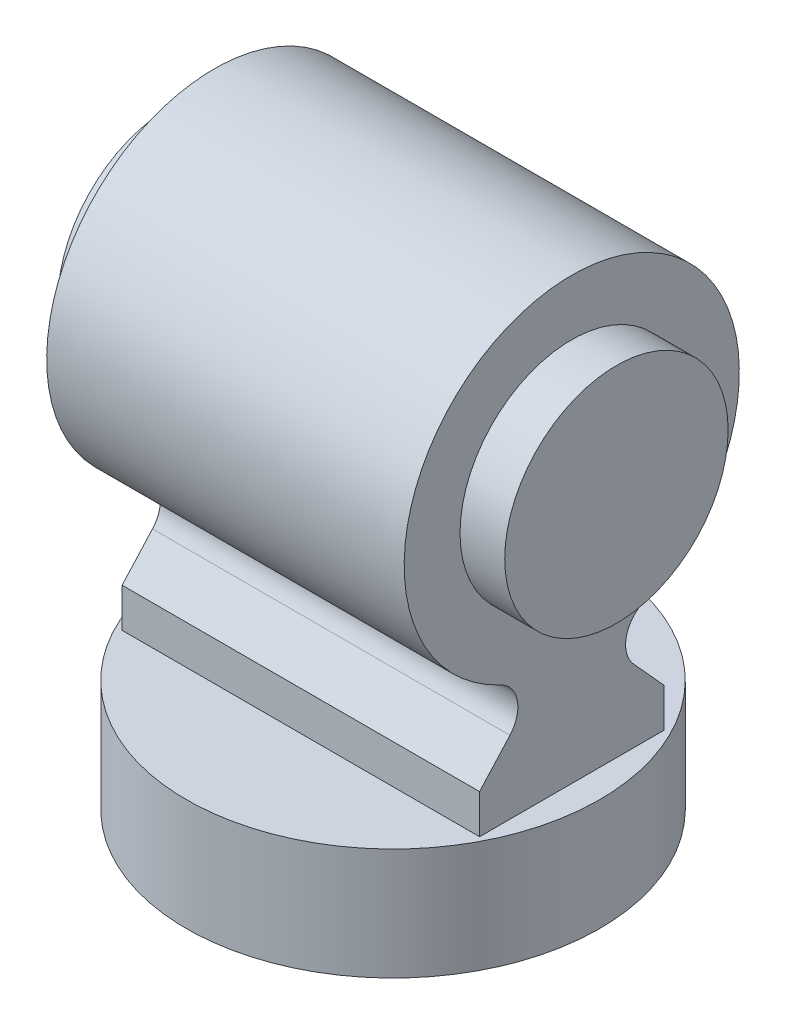
ISO-10303-21;
HEADER;
FILE_DESCRIPTION(('STEP AP214'),'2;1');
FILE_NAME('part.step','',(''),(''),'','','');
FILE_SCHEMA(('AUTOMOTIVE_DESIGN { 1 0 10303 214 1 1 1 1 }'));
ENDSEC;
DATA;
#1=APPLICATION_CONTEXT('core data for automotive mechanical design processes');
#2=APPLICATION_PROTOCOL_DEFINITION('international standard','automotive_design',2000,#1);
#3=PRODUCT_CONTEXT('',#1,'mechanical');
#4=PRODUCT('Part','Part','',(#3));
#5=PRODUCT_RELATED_PRODUCT_CATEGORY('part','',(#4));
#6=PRODUCT_DEFINITION_FORMATION('','',#4);
#7=PRODUCT_DEFINITION_CONTEXT('part definition',#1,'design');
#8=PRODUCT_DEFINITION('design','',#6,#7);
#9=PRODUCT_DEFINITION_SHAPE('','',#8);
#10=(LENGTH_UNIT() NAMED_UNIT(*) SI_UNIT(.MILLI.,.METRE.));
#11=(NAMED_UNIT(*) PLANE_ANGLE_UNIT() SI_UNIT($,.RADIAN.));
#12=(NAMED_UNIT(*) SI_UNIT($,.STERADIAN.) SOLID_ANGLE_UNIT());
#13=UNCERTAINTY_MEASURE_WITH_UNIT(LENGTH_MEASURE(1.E-05),#10,'distance_accuracy_value','');
#14=(GEOMETRIC_REPRESENTATION_CONTEXT(3) GLOBAL_UNCERTAINTY_ASSIGNED_CONTEXT((#13)) GLOBAL_UNIT_ASSIGNED_CONTEXT((#10,
#11,#12)) REPRESENTATION_CONTEXT('',''));
#15=CARTESIAN_POINT('',(0.,0.,0.));
#16=DIRECTION('',(0.,0.,1.));
#17=DIRECTION('',(1.,0.,0.));
#18=AXIS2_PLACEMENT_3D('',#15,#16,#17);
#19=CARTESIAN_POINT('',(-32.,-32.1160022418731,-15.15));
#20=DIRECTION('',(1.,0.,0.));
#21=DIRECTION('',(0.,0.,-1.));
#22=AXIS2_PLACEMENT_3D('',#19,#20,#21);
#23=CYLINDRICAL_SURFACE('',#22,5.51);
#24=DIRECTION('',(1.,0.,0.));
#25=VECTOR('',#24,1.);
#26=CARTESIAN_POINT('',(-32.,-27.132640587333,-12.7992114897212));
#27=LINE('',#26,#25);
#28=CARTESIAN_POINT('',(-32.,-27.132640587333,-12.7992114897212));
#29=VERTEX_POINT('',#28);
#30=CARTESIAN_POINT('',(32.,-27.132640587333,-12.7992114897212));
#31=VERTEX_POINT('',#30);
#32=EDGE_CURVE('E139',#29,#31,#27,.T.);
#33=ORIENTED_EDGE('',*,*,#32,.T.);
#34=CARTESIAN_POINT('',(32.,-32.1160022418731,-15.15));
#35=DIRECTION('',(-1.,0.,0.));
#36=DIRECTION('',(0.,0.,-1.));
#37=AXIS2_PLACEMENT_3D('',#34,#35,#36);
#38=CIRCLE('',#37,5.51);
#39=CARTESIAN_POINT('',(32.,-35.8064974081402,-11.0585032778017));
#40=VERTEX_POINT('',#39);
#41=EDGE_CURVE('E150',#40,#31,#38,.T.);
#42=ORIENTED_EDGE('',*,*,#41,.F.);
#43=DIRECTION('',(1.,0.,0.));
#44=VECTOR('',#43,1.);
#45=CARTESIAN_POINT('',(-32.,-35.8064974081402,-11.0585032778017));
#46=LINE('',#45,#44);
#47=CARTESIAN_POINT('',(-32.,-35.8064974081402,-11.0585032778017));
#48=VERTEX_POINT('',#47);
#49=EDGE_CURVE('E53',#48,#40,#46,.T.);
#50=ORIENTED_EDGE('',*,*,#49,.F.);
#51=CARTESIAN_POINT('',(-32.,-32.1160022418731,-15.15));
#52=DIRECTION('',(-1.,0.,0.));
#53=DIRECTION('',(0.,0.,-1.));
#54=AXIS2_PLACEMENT_3D('',#51,#52,#53);
#55=CIRCLE('',#54,5.51);
#56=EDGE_CURVE('E151',#48,#29,#55,.T.);
#57=ORIENTED_EDGE('',*,*,#56,.T.);
#58=EDGE_LOOP('',(#33,#42,#50,#57));
#59=FACE_BOUND('',#58,.T.);
#60=ADVANCED_FACE('F46',(#59),#23,.F.);
#61=CARTESIAN_POINT('',(-32.,-35.8064974081402,-11.0585032778017));
#62=DIRECTION('',(0.,0.670961371417795,-0.741492304791595));
#63=DIRECTION('',(0.,0.741492304791595,0.670961371417795));
#64=AXIS2_PLACEMENT_3D('',#61,#62,#63);
#65=PLANE('',#64);
#66=ORIENTED_EDGE('',*,*,#49,.T.);
#67=DIRECTION('',(0.,0.741492304791595,0.670961371417795));
#68=VECTOR('',#67,1.);
#69=CARTESIAN_POINT('',(32.,-35.8064974081402,-11.0585032778017));
#70=LINE('',#69,#68);
#71=CARTESIAN_POINT('',(32.,-41.82,-16.5));
#72=VERTEX_POINT('',#71);
#73=EDGE_CURVE('E165',#72,#40,#70,.T.);
#74=ORIENTED_EDGE('',*,*,#73,.F.);
#75=DIRECTION('',(1.,0.,0.));
#76=VECTOR('',#75,1.);
#77=CARTESIAN_POINT('',(-32.,-41.82,-16.5));
#78=LINE('',#77,#76);
#79=CARTESIAN_POINT('',(-32.,-41.82,-16.5));
#80=VERTEX_POINT('',#79);
#81=EDGE_CURVE('E67',#80,#72,#78,.T.);
#82=ORIENTED_EDGE('',*,*,#81,.F.);
#83=DIRECTION('',(0.,0.741492304791595,0.670961371417795));
#84=VECTOR('',#83,1.);
#85=CARTESIAN_POINT('',(-32.,-35.8064974081402,-11.0585032778017));
#86=LINE('',#85,#84);
#87=EDGE_CURVE('E117',#80,#48,#86,.T.);
#88=ORIENTED_EDGE('',*,*,#87,.T.);
#89=EDGE_LOOP('',(#66,#74,#82,#88));
#90=FACE_BOUND('',#89,.T.);
#91=ADVANCED_FACE('F207',(#90),#65,.T.);
#92=CARTESIAN_POINT('',(-32.,-41.82,-16.5));
#93=DIRECTION('',(0.,0.,-1.));
#94=DIRECTION('',(0.,1.,0.));
#95=AXIS2_PLACEMENT_3D('',#92,#93,#94);
#96=PLANE('',#95);
#97=ORIENTED_EDGE('',*,*,#81,.T.);
#98=DIRECTION('',(0.,1.,0.));
#99=VECTOR('',#98,1.);
#100=CARTESIAN_POINT('',(32.,-41.82,-16.5));
#101=LINE('',#100,#99);
#102=CARTESIAN_POINT('',(32.,-48.82,-16.5));
#103=VERTEX_POINT('',#102);
#104=EDGE_CURVE('E125',#103,#72,#101,.T.);
#105=ORIENTED_EDGE('',*,*,#104,.F.);
#106=DIRECTION('',(1.,0.,0.));
#107=VECTOR('',#106,1.);
#108=CARTESIAN_POINT('',(-32.,-48.82,-16.5));
#109=LINE('',#108,#107);
#110=CARTESIAN_POINT('',(-32.,-48.82,-16.5));
#111=VERTEX_POINT('',#110);
#112=EDGE_CURVE('E122',#111,#103,#109,.T.);
#113=ORIENTED_EDGE('',*,*,#112,.F.);
#114=DIRECTION('',(0.,1.,0.));
#115=VECTOR('',#114,1.);
#116=CARTESIAN_POINT('',(-32.,-41.82,-16.5));
#117=LINE('',#116,#115);
#118=EDGE_CURVE('E110',#111,#80,#117,.T.);
#119=ORIENTED_EDGE('',*,*,#118,.T.);
#120=EDGE_LOOP('',(#97,#105,#113,#119));
#121=FACE_BOUND('',#120,.T.);
#122=ADVANCED_FACE('F123',(#121),#96,.T.);
#123=CARTESIAN_POINT('',(-32.,-41.82,16.5));
#124=DIRECTION('',(0.,0.,1.));
#125=DIRECTION('',(0.,-1.,0.));
#126=AXIS2_PLACEMENT_3D('',#123,#124,#125);
#127=PLANE('',#126);
#128=DIRECTION('',(1.,0.,0.));
#129=VECTOR('',#128,1.);
#130=CARTESIAN_POINT('',(-32.,-48.82,16.5));
#131=LINE('',#130,#129);
#132=CARTESIAN_POINT('',(-32.,-48.82,16.5));
#133=VERTEX_POINT('',#132);
#134=CARTESIAN_POINT('',(32.,-48.82,16.5));
#135=VERTEX_POINT('',#134);
#136=EDGE_CURVE('E128',#133,#135,#131,.T.);
#137=ORIENTED_EDGE('',*,*,#136,.T.);
#138=DIRECTION('',(0.,-1.,0.));
#139=VECTOR('',#138,1.);
#140=CARTESIAN_POINT('',(32.,-41.82,16.5));
#141=LINE('',#140,#139);
#142=CARTESIAN_POINT('',(32.,-41.82,16.5));
#143=VERTEX_POINT('',#142);
#144=EDGE_CURVE('E177',#143,#135,#141,.T.);
#145=ORIENTED_EDGE('',*,*,#144,.F.);
#146=DIRECTION('',(1.,0.,0.));
#147=VECTOR('',#146,1.);
#148=CARTESIAN_POINT('',(-32.,-41.82,16.5));
#149=LINE('',#148,#147);
#150=CARTESIAN_POINT('',(-32.,-41.82,16.5));
#151=VERTEX_POINT('',#150);
#152=EDGE_CURVE('E143',#151,#143,#149,.T.);
#153=ORIENTED_EDGE('',*,*,#152,.F.);
#154=DIRECTION('',(0.,-1.,0.));
#155=VECTOR('',#154,1.);
#156=CARTESIAN_POINT('',(-32.,-41.82,16.5));
#157=LINE('',#156,#155);
#158=EDGE_CURVE('E132',#151,#133,#157,.T.);
#159=ORIENTED_EDGE('',*,*,#158,.T.);
#160=EDGE_LOOP('',(#137,#145,#153,#159));
#161=FACE_BOUND('',#160,.T.);
#162=ADVANCED_FACE('F199',(#161),#127,.T.);
#163=CARTESIAN_POINT('',(-32.,-35.8064974081402,11.0585032778017));
#164=DIRECTION('',(0.,0.670961371417795,0.741492304791595));
#165=DIRECTION('',(0.,-0.741492304791595,0.670961371417795));
#166=AXIS2_PLACEMENT_3D('',#163,#164,#165);
#167=PLANE('',#166);
#168=ORIENTED_EDGE('',*,*,#152,.T.);
#169=DIRECTION('',(0.,-0.741492304791595,0.670961371417795));
#170=VECTOR('',#169,1.);
#171=CARTESIAN_POINT('',(32.,-35.8064974081402,11.0585032778017));
#172=LINE('',#171,#170);
#173=CARTESIAN_POINT('',(32.,-35.8064974081402,11.0585032778017));
#174=VERTEX_POINT('',#173);
#175=EDGE_CURVE('E174',#174,#143,#172,.T.);
#176=ORIENTED_EDGE('',*,*,#175,.F.);
#177=DIRECTION('',(1.,0.,0.));
#178=VECTOR('',#177,1.);
#179=CARTESIAN_POINT('',(-32.,-35.8064974081402,11.0585032778017));
#180=LINE('',#179,#178);
#181=CARTESIAN_POINT('',(-32.,-35.8064974081402,11.0585032778017));
#182=VERTEX_POINT('',#181);
#183=EDGE_CURVE('E145',#182,#174,#180,.T.);
#184=ORIENTED_EDGE('',*,*,#183,.F.);
#185=DIRECTION('',(0.,-0.741492304791595,0.670961371417795));
#186=VECTOR('',#185,1.);
#187=CARTESIAN_POINT('',(-32.,-35.8064974081402,11.0585032778017));
#188=LINE('',#187,#186);
#189=EDGE_CURVE('E134',#182,#151,#188,.T.);
#190=ORIENTED_EDGE('',*,*,#189,.T.);
#191=EDGE_LOOP('',(#168,#176,#184,#190));
#192=FACE_BOUND('',#191,.T.);
#193=ADVANCED_FACE('F192',(#192),#167,.T.);
#194=CARTESIAN_POINT('',(-32.,-32.1160022418731,15.15));
#195=DIRECTION('',(1.,0.,0.));
#196=DIRECTION('',(0.,0.,-1.));
#197=AXIS2_PLACEMENT_3D('',#194,#195,#196);
#198=CYLINDRICAL_SURFACE('',#197,5.51);
#199=ORIENTED_EDGE('',*,*,#183,.T.);
#200=CARTESIAN_POINT('',(32.,-32.1160022418731,15.15));
#201=DIRECTION('',(-1.,0.,0.));
#202=DIRECTION('',(0.,0.,1.));
#203=AXIS2_PLACEMENT_3D('',#200,#201,#202);
#204=CIRCLE('',#203,5.51);
#205=CARTESIAN_POINT('',(32.,-27.132640587333,12.7992114897212));
#206=VERTEX_POINT('',#205);
#207=EDGE_CURVE('E161',#206,#174,#204,.T.);
#208=ORIENTED_EDGE('',*,*,#207,.F.);
#209=DIRECTION('',(1.,0.,0.));
#210=VECTOR('',#209,1.);
#211=CARTESIAN_POINT('',(-32.,-27.132640587333,12.7992114897212));
#212=LINE('',#211,#210);
#213=CARTESIAN_POINT('',(-32.,-27.132640587333,12.7992114897212));
#214=VERTEX_POINT('',#213);
#215=EDGE_CURVE('E147',#214,#206,#212,.T.);
#216=ORIENTED_EDGE('',*,*,#215,.F.);
#217=CARTESIAN_POINT('',(-32.,-32.1160022418731,15.15));
#218=DIRECTION('',(-1.,0.,0.));
#219=DIRECTION('',(0.,0.,1.));
#220=AXIS2_PLACEMENT_3D('',#217,#218,#219);
#221=CIRCLE('',#220,5.51);
#222=EDGE_CURVE('E187',#214,#182,#221,.T.);
#223=ORIENTED_EDGE('',*,*,#222,.T.);
#224=EDGE_LOOP('',(#199,#208,#216,#223));
#225=FACE_BOUND('',#224,.T.);
#226=ADVANCED_FACE('F196',(#225),#198,.F.);
#227=CARTESIAN_POINT('',(-32.,0.,0.));
#228=DIRECTION('',(1.,0.,0.));
#229=DIRECTION('',(0.,0.,-1.));
#230=AXIS2_PLACEMENT_3D('',#227,#228,#229);
#231=CYLINDRICAL_SURFACE('',#230,30.);
#232=ORIENTED_EDGE('',*,*,#215,.T.);
#233=CARTESIAN_POINT('',(32.,0.,0.));
#234=DIRECTION('',(1.,0.,0.));
#235=DIRECTION('',(0.,0.,-1.));
#236=AXIS2_PLACEMENT_3D('',#233,#234,#235);
#237=CIRCLE('',#236,30.);
#238=EDGE_CURVE('E156',#31,#206,#237,.T.);
#239=ORIENTED_EDGE('',*,*,#238,.F.);
#240=ORIENTED_EDGE('',*,*,#32,.F.);
#241=CARTESIAN_POINT('',(-32.,0.,0.));
#242=DIRECTION('',(1.,0.,0.));
#243=DIRECTION('',(0.,0.,-1.));
#244=AXIS2_PLACEMENT_3D('',#241,#242,#243);
#245=CIRCLE('',#244,30.);
#246=EDGE_CURVE('E185',#29,#214,#245,.T.);
#247=ORIENTED_EDGE('',*,*,#246,.T.);
#248=EDGE_LOOP('',(#232,#239,#240,#247));
#249=FACE_BOUND('',#248,.T.);
#250=ADVANCED_FACE('F157',(#249),#231,.T.);
#251=CARTESIAN_POINT('',(-32.,-32.1160022418731,-15.15));
#252=DIRECTION('',(1.,0.,0.));
#253=DIRECTION('',(0.,0.,-1.));
#254=AXIS2_PLACEMENT_3D('',#251,#252,#253);
#255=PLANE('',#254);
#256=CARTESIAN_POINT('',(-32.,0.,0.));
#257=DIRECTION('',(1.,0.,0.));
#258=DIRECTION('',(0.,0.,-1.));
#259=AXIS2_PLACEMENT_3D('',#256,#257,#258);
#260=CIRCLE('',#259,20.);
#261=CARTESIAN_POINT('',(-32.,0.,-20.));
#262=VERTEX_POINT('',#261);
#263=EDGE_CURVE('E13',#262,#262,#260,.F.);
#264=ORIENTED_EDGE('',*,*,#263,.F.);
#265=EDGE_LOOP('',(#264));
#266=FACE_BOUND('',#265,.T.);
#267=ORIENTED_EDGE('',*,*,#56,.F.);
#268=ORIENTED_EDGE('',*,*,#87,.F.);
#269=ORIENTED_EDGE('',*,*,#118,.F.);
#270=DIRECTION('',(0.,0.,-1.));
#271=VECTOR('',#270,1.);
#272=CARTESIAN_POINT('',(-32.,-48.82,-16.5));
#273=LINE('',#272,#271);
#274=EDGE_CURVE('E115',#133,#111,#273,.T.);
#275=ORIENTED_EDGE('',*,*,#274,.F.);
#276=ORIENTED_EDGE('',*,*,#158,.F.);
#277=ORIENTED_EDGE('',*,*,#189,.F.);
#278=ORIENTED_EDGE('',*,*,#222,.F.);
#279=ORIENTED_EDGE('',*,*,#246,.F.);
#280=EDGE_LOOP('',(#267,#268,#269,#275,#276,#277,#278,#279));
#281=FACE_BOUND('',#280,.T.);
#282=ADVANCED_FACE('F112',(#266,#281),#255,.F.);
#283=CARTESIAN_POINT('',(32.,-32.1160022418731,-15.15));
#284=DIRECTION('',(1.,0.,0.));
#285=DIRECTION('',(0.,0.,-1.));
#286=AXIS2_PLACEMENT_3D('',#283,#284,#285);
#287=PLANE('',#286);
#288=CARTESIAN_POINT('',(32.,0.,0.));
#289=DIRECTION('',(1.,0.,0.));
#290=DIRECTION('',(0.,0.,-1.));
#291=AXIS2_PLACEMENT_3D('',#288,#289,#290);
#292=CIRCLE('',#291,20.);
#293=CARTESIAN_POINT('',(32.,0.,-20.));
#294=VERTEX_POINT('',#293);
#295=EDGE_CURVE('E169',#294,#294,#292,.T.);
#296=ORIENTED_EDGE('',*,*,#295,.F.);
#297=EDGE_LOOP('',(#296));
#298=FACE_BOUND('',#297,.T.);
#299=ORIENTED_EDGE('',*,*,#41,.T.);
#300=ORIENTED_EDGE('',*,*,#238,.T.);
#301=ORIENTED_EDGE('',*,*,#207,.T.);
#302=ORIENTED_EDGE('',*,*,#175,.T.);
#303=ORIENTED_EDGE('',*,*,#144,.T.);
#304=DIRECTION('',(0.,0.,-1.));
#305=VECTOR('',#304,1.);
#306=CARTESIAN_POINT('',(32.,-48.82,-16.5));
#307=LINE('',#306,#305);
#308=EDGE_CURVE('E180',#135,#103,#307,.T.);
#309=ORIENTED_EDGE('',*,*,#308,.T.);
#310=ORIENTED_EDGE('',*,*,#104,.T.);
#311=ORIENTED_EDGE('',*,*,#73,.T.);
#312=EDGE_LOOP('',(#299,#300,#301,#302,#303,#309,#310,#311));
#313=FACE_BOUND('',#312,.T.);
#314=ADVANCED_FACE('F164',(#298,#313),#287,.T.);
#315=CARTESIAN_POINT('',(40.,0.,0.));
#316=DIRECTION('',(-1.,0.,0.));
#317=DIRECTION('',(0.,0.,1.));
#318=AXIS2_PLACEMENT_3D('',#315,#316,#317);
#319=CYLINDRICAL_SURFACE('',#318,20.);
#320=CARTESIAN_POINT('',(40.,0.,0.));
#321=DIRECTION('',(1.,0.,0.));
#322=DIRECTION('',(0.,0.,-1.));
#323=AXIS2_PLACEMENT_3D('',#320,#321,#322);
#324=CIRCLE('',#323,20.);
#325=CARTESIAN_POINT('',(40.,0.,-20.));
#326=VERTEX_POINT('',#325);
#327=EDGE_CURVE('E166',#326,#326,#324,.T.);
#328=ORIENTED_EDGE('',*,*,#327,.F.);
#329=EDGE_LOOP('',(#328));
#330=FACE_BOUND('',#329,.T.);
#331=ORIENTED_EDGE('',*,*,#295,.T.);
#332=EDGE_LOOP('',(#331));
#333=FACE_BOUND('',#332,.T.);
#334=ADVANCED_FACE('F222',(#330,#333),#319,.T.);
#335=CARTESIAN_POINT('',(40.,0.,0.));
#336=DIRECTION('',(1.,0.,0.));
#337=DIRECTION('',(0.,0.,-1.));
#338=AXIS2_PLACEMENT_3D('',#335,#336,#337);
#339=PLANE('',#338);
#340=ORIENTED_EDGE('',*,*,#327,.T.);
#341=EDGE_LOOP('',(#340));
#342=FACE_BOUND('',#341,.T.);
#343=ADVANCED_FACE('F226',(#342),#339,.T.);
#344=CARTESIAN_POINT('',(-40.,0.,0.));
#345=DIRECTION('',(1.,0.,0.));
#346=DIRECTION('',(0.,0.,-1.));
#347=AXIS2_PLACEMENT_3D('',#344,#345,#346);
#348=CYLINDRICAL_SURFACE('',#347,20.);
#349=CARTESIAN_POINT('',(-40.,0.,0.));
#350=DIRECTION('',(-1.,0.,0.));
#351=DIRECTION('',(0.,0.,1.));
#352=AXIS2_PLACEMENT_3D('',#349,#350,#351);
#353=CIRCLE('',#352,20.);
#354=CARTESIAN_POINT('',(-40.,0.,20.));
#355=VERTEX_POINT('',#354);
#356=EDGE_CURVE('E254',#355,#355,#353,.T.);
#357=ORIENTED_EDGE('',*,*,#356,.F.);
#358=EDGE_LOOP('',(#357));
#359=FACE_BOUND('',#358,.T.);
#360=ORIENTED_EDGE('',*,*,#263,.T.);
#361=EDGE_LOOP('',(#360));
#362=FACE_BOUND('',#361,.T.);
#363=ADVANCED_FACE('F230',(#359,#362),#348,.T.);
#364=CARTESIAN_POINT('',(-40.,0.,0.));
#365=DIRECTION('',(-1.,0.,0.));
#366=DIRECTION('',(0.,0.,1.));
#367=AXIS2_PLACEMENT_3D('',#364,#365,#366);
#368=PLANE('',#367);
#369=ORIENTED_EDGE('',*,*,#356,.T.);
#370=EDGE_LOOP('',(#369));
#371=FACE_BOUND('',#370,.T.);
#372=ADVANCED_FACE('F234',(#371),#368,.T.);
#373=CARTESIAN_POINT('',(0.,-48.82,0.));
#374=DIRECTION('',(0.,-1.,0.));
#375=DIRECTION('',(0.,0.,-1.));
#376=AXIS2_PLACEMENT_3D('',#373,#374,#375);
#377=PLANE('',#376);
#378=CARTESIAN_POINT('',(0.,-48.82,0.));
#379=DIRECTION('',(0.,-1.,0.));
#380=DIRECTION('',(0.,0.,-1.));
#381=AXIS2_PLACEMENT_3D('',#378,#379,#380);
#382=CIRCLE('',#381,37.);
#383=CARTESIAN_POINT('',(0.,-48.82,-37.));
#384=VERTEX_POINT('',#383);
#385=EDGE_CURVE('E255',#384,#384,#382,.T.);
#386=ORIENTED_EDGE('',*,*,#385,.F.);
#387=EDGE_LOOP('',(#386));
#388=FACE_BOUND('',#387,.T.);
#389=ORIENTED_EDGE('',*,*,#274,.T.);
#390=ORIENTED_EDGE('',*,*,#112,.T.);
#391=ORIENTED_EDGE('',*,*,#308,.F.);
#392=ORIENTED_EDGE('',*,*,#136,.F.);
#393=EDGE_LOOP('',(#389,#390,#391,#392));
#394=FACE_BOUND('',#393,.T.);
#395=ADVANCED_FACE('F131',(#388,#394),#377,.F.);
#396=CARTESIAN_POINT('',(0.,-68.82,0.));
#397=DIRECTION('',(0.,1.,0.));
#398=DIRECTION('',(0.,0.,1.));
#399=AXIS2_PLACEMENT_3D('',#396,#397,#398);
#400=CYLINDRICAL_SURFACE('',#399,37.);
#401=CARTESIAN_POINT('',(0.,-68.82,0.));
#402=DIRECTION('',(0.,-1.,0.));
#403=DIRECTION('',(0.,0.,-1.));
#404=AXIS2_PLACEMENT_3D('',#401,#402,#403);
#405=CIRCLE('',#404,37.);
#406=CARTESIAN_POINT('',(0.,-68.82,-37.));
#407=VERTEX_POINT('',#406);
#408=EDGE_CURVE('E253',#407,#407,#405,.T.);
#409=ORIENTED_EDGE('',*,*,#408,.F.);
#410=EDGE_LOOP('',(#409));
#411=FACE_BOUND('',#410,.T.);
#412=ORIENTED_EDGE('',*,*,#385,.T.);
#413=EDGE_LOOP('',(#412));
#414=FACE_BOUND('',#413,.T.);
#415=ADVANCED_FACE('F239',(#411,#414),#400,.T.);
#416=CARTESIAN_POINT('',(0.,-68.82,0.));
#417=DIRECTION('',(0.,-1.,0.));
#418=DIRECTION('',(0.,0.,-1.));
#419=AXIS2_PLACEMENT_3D('',#416,#417,#418);
#420=PLANE('',#419);
#421=ORIENTED_EDGE('',*,*,#408,.T.);
#422=EDGE_LOOP('',(#421));
#423=FACE_BOUND('',#422,.T.);
#424=ADVANCED_FACE('F242',(#423),#420,.T.);
#425=CLOSED_SHELL('',(#60,#91,#122,#162,#193,#226,#250,#282,#314,#334,#343,#363,#372,#395,#415,#424));
#426=MANIFOLD_SOLID_BREP('B2',#425);
#427=ADVANCED_BREP_SHAPE_REPRESENTATION('',(#18,#426),#14);
#428=SHAPE_DEFINITION_REPRESENTATION(#9,#427);
ENDSEC;
END-ISO-10303-21;
